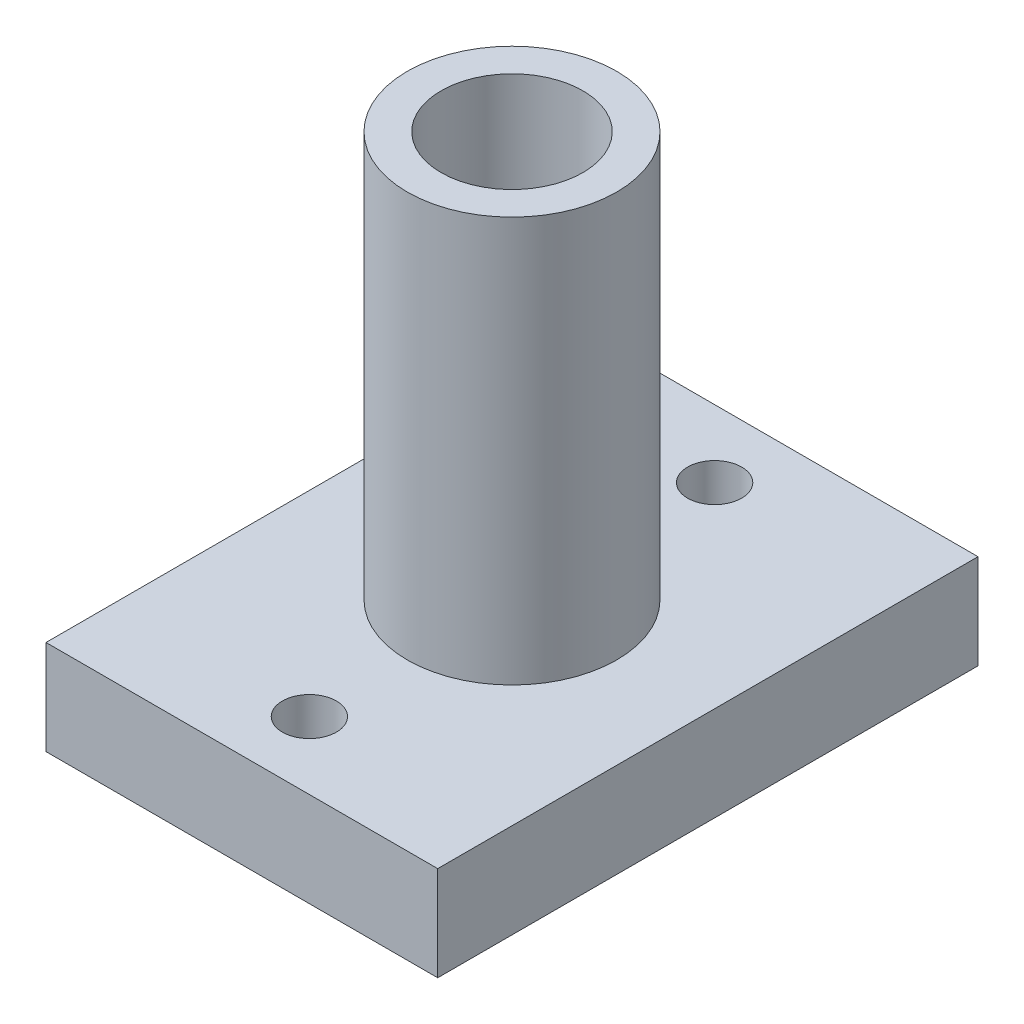
ISO-10303-21;
HEADER;
FILE_DESCRIPTION(('STEP AP214'),'2;1');
FILE_NAME('part.step','',(''),(''),'','','');
FILE_SCHEMA(('AUTOMOTIVE_DESIGN { 1 0 10303 214 1 1 1 1 }'));
ENDSEC;
DATA;
#1=APPLICATION_CONTEXT('core data for automotive mechanical design processes');
#2=APPLICATION_PROTOCOL_DEFINITION('international standard','automotive_design',2000,#1);
#3=PRODUCT_CONTEXT('',#1,'mechanical');
#4=PRODUCT('Part','Part','',(#3));
#5=PRODUCT_RELATED_PRODUCT_CATEGORY('part','',(#4));
#6=PRODUCT_DEFINITION_FORMATION('','',#4);
#7=PRODUCT_DEFINITION_CONTEXT('part definition',#1,'design');
#8=PRODUCT_DEFINITION('design','',#6,#7);
#9=PRODUCT_DEFINITION_SHAPE('','',#8);
#10=(LENGTH_UNIT() NAMED_UNIT(*) SI_UNIT(.MILLI.,.METRE.));
#11=(NAMED_UNIT(*) PLANE_ANGLE_UNIT() SI_UNIT($,.RADIAN.));
#12=(NAMED_UNIT(*) SI_UNIT($,.STERADIAN.) SOLID_ANGLE_UNIT());
#13=UNCERTAINTY_MEASURE_WITH_UNIT(LENGTH_MEASURE(1.E-05),#10,'distance_accuracy_value','');
#14=(GEOMETRIC_REPRESENTATION_CONTEXT(3) GLOBAL_UNCERTAINTY_ASSIGNED_CONTEXT((#13)) GLOBAL_UNIT_ASSIGNED_CONTEXT((#10,
#11,#12)) REPRESENTATION_CONTEXT('',''));
#15=CARTESIAN_POINT('',(0.,0.,0.));
#16=DIRECTION('',(0.,0.,1.));
#17=DIRECTION('',(1.,0.,0.));
#18=AXIS2_PLACEMENT_3D('',#15,#16,#17);
#19=CARTESIAN_POINT('',(14.5,3.5,20.));
#20=DIRECTION('',(-1.,0.,0.));
#21=DIRECTION('',(0.,0.,1.));
#22=AXIS2_PLACEMENT_3D('',#19,#20,#21);
#23=PLANE('',#22);
#24=DIRECTION('',(0.,1.,0.));
#25=VECTOR('',#24,1.);
#26=CARTESIAN_POINT('',(14.5,3.5,-20.));
#27=LINE('',#26,#25);
#28=CARTESIAN_POINT('',(14.5,-3.5,-20.));
#29=VERTEX_POINT('',#28);
#30=CARTESIAN_POINT('',(14.5,3.5,-20.));
#31=VERTEX_POINT('',#30);
#32=EDGE_CURVE('E107',#29,#31,#27,.T.);
#33=ORIENTED_EDGE('',*,*,#32,.T.);
#34=DIRECTION('',(0.,0.,-1.));
#35=VECTOR('',#34,1.);
#36=CARTESIAN_POINT('',(14.5,3.5,20.));
#37=LINE('',#36,#35);
#38=CARTESIAN_POINT('',(14.5,3.5,20.));
#39=VERTEX_POINT('',#38);
#40=EDGE_CURVE('E49',#39,#31,#37,.T.);
#41=ORIENTED_EDGE('',*,*,#40,.F.);
#42=DIRECTION('',(0.,1.,0.));
#43=VECTOR('',#42,1.);
#44=CARTESIAN_POINT('',(14.5,3.5,20.));
#45=LINE('',#44,#43);
#46=CARTESIAN_POINT('',(14.5,-3.5,20.));
#47=VERTEX_POINT('',#46);
#48=EDGE_CURVE('E93',#47,#39,#45,.T.);
#49=ORIENTED_EDGE('',*,*,#48,.F.);
#50=DIRECTION('',(0.,0.,-1.));
#51=VECTOR('',#50,1.);
#52=CARTESIAN_POINT('',(14.5,-3.5,20.));
#53=LINE('',#52,#51);
#54=EDGE_CURVE('E103',#47,#29,#53,.T.);
#55=ORIENTED_EDGE('',*,*,#54,.T.);
#56=EDGE_LOOP('',(#33,#41,#49,#55));
#57=FACE_BOUND('',#56,.T.);
#58=ADVANCED_FACE('F41',(#57),#23,.F.);
#59=CARTESIAN_POINT('',(-14.5,3.5,20.));
#60=DIRECTION('',(0.,-1.,0.));
#61=DIRECTION('',(0.,0.,-1.));
#62=AXIS2_PLACEMENT_3D('',#59,#60,#61);
#63=PLANE('',#62);
#64=CARTESIAN_POINT('',(0.,3.5,0.));
#65=DIRECTION('',(0.,-1.,0.));
#66=DIRECTION('',(0.,0.,-1.));
#67=AXIS2_PLACEMENT_3D('',#64,#65,#66);
#68=CIRCLE('',#67,7.75);
#69=CARTESIAN_POINT('',(0.,3.5,-7.75));
#70=VERTEX_POINT('',#69);
#71=EDGE_CURVE('E12',#70,#70,#68,.F.);
#72=ORIENTED_EDGE('',*,*,#71,.F.);
#73=EDGE_LOOP('',(#72));
#74=FACE_BOUND('',#73,.T.);
#75=CARTESIAN_POINT('',(0.,3.5,-15.));
#76=DIRECTION('',(0.,1.,0.));
#77=DIRECTION('',(0.,0.,1.));
#78=AXIS2_PLACEMENT_3D('',#75,#76,#77);
#79=CIRCLE('',#78,2.);
#80=CARTESIAN_POINT('',(0.,3.5,-13.));
#81=VERTEX_POINT('',#80);
#82=EDGE_CURVE('E168',#81,#81,#79,.T.);
#83=ORIENTED_EDGE('',*,*,#82,.F.);
#84=EDGE_LOOP('',(#83));
#85=FACE_BOUND('',#84,.T.);
#86=CARTESIAN_POINT('',(0.,3.5,15.));
#87=DIRECTION('',(0.,1.,0.));
#88=DIRECTION('',(0.,0.,-1.));
#89=AXIS2_PLACEMENT_3D('',#86,#87,#88);
#90=CIRCLE('',#89,2.);
#91=CARTESIAN_POINT('',(0.,3.5,13.));
#92=VERTEX_POINT('',#91);
#93=EDGE_CURVE('E165',#92,#92,#90,.T.);
#94=ORIENTED_EDGE('',*,*,#93,.F.);
#95=EDGE_LOOP('',(#94));
#96=FACE_BOUND('',#95,.T.);
#97=DIRECTION('',(-1.,0.,0.));
#98=VECTOR('',#97,1.);
#99=CARTESIAN_POINT('',(-14.5,3.5,-20.));
#100=LINE('',#99,#98);
#101=CARTESIAN_POINT('',(-14.5,3.5,-20.));
#102=VERTEX_POINT('',#101);
#103=EDGE_CURVE('E98',#31,#102,#100,.T.);
#104=ORIENTED_EDGE('',*,*,#103,.T.);
#105=DIRECTION('',(0.,0.,-1.));
#106=VECTOR('',#105,1.);
#107=CARTESIAN_POINT('',(-14.5,3.5,20.));
#108=LINE('',#107,#106);
#109=CARTESIAN_POINT('',(-14.5,3.5,20.));
#110=VERTEX_POINT('',#109);
#111=EDGE_CURVE('E96',#110,#102,#108,.T.);
#112=ORIENTED_EDGE('',*,*,#111,.F.);
#113=DIRECTION('',(-1.,0.,0.));
#114=VECTOR('',#113,1.);
#115=CARTESIAN_POINT('',(-14.5,3.5,20.));
#116=LINE('',#115,#114);
#117=EDGE_CURVE('E88',#39,#110,#116,.T.);
#118=ORIENTED_EDGE('',*,*,#117,.F.);
#119=ORIENTED_EDGE('',*,*,#40,.T.);
#120=EDGE_LOOP('',(#104,#112,#118,#119));
#121=FACE_BOUND('',#120,.T.);
#122=ADVANCED_FACE('F97',(#74,#85,#96,#121),#63,.F.);
#123=CARTESIAN_POINT('',(-14.5,3.5,20.));
#124=DIRECTION('',(1.,0.,0.));
#125=DIRECTION('',(0.,0.,-1.));
#126=AXIS2_PLACEMENT_3D('',#123,#124,#125);
#127=PLANE('',#126);
#128=DIRECTION('',(0.,-1.,0.));
#129=VECTOR('',#128,1.);
#130=CARTESIAN_POINT('',(-14.5,3.5,-20.));
#131=LINE('',#130,#129);
#132=CARTESIAN_POINT('',(-14.5,-3.5,-20.));
#133=VERTEX_POINT('',#132);
#134=EDGE_CURVE('E74',#102,#133,#131,.T.);
#135=ORIENTED_EDGE('',*,*,#134,.T.);
#136=DIRECTION('',(0.,0.,-1.));
#137=VECTOR('',#136,1.);
#138=CARTESIAN_POINT('',(-14.5,-3.5,20.));
#139=LINE('',#138,#137);
#140=CARTESIAN_POINT('',(-14.5,-3.5,20.));
#141=VERTEX_POINT('',#140);
#142=EDGE_CURVE('E99',#141,#133,#139,.T.);
#143=ORIENTED_EDGE('',*,*,#142,.F.);
#144=DIRECTION('',(0.,-1.,0.));
#145=VECTOR('',#144,1.);
#146=CARTESIAN_POINT('',(-14.5,3.5,20.));
#147=LINE('',#146,#145);
#148=EDGE_CURVE('E91',#110,#141,#147,.T.);
#149=ORIENTED_EDGE('',*,*,#148,.F.);
#150=ORIENTED_EDGE('',*,*,#111,.T.);
#151=EDGE_LOOP('',(#135,#143,#149,#150));
#152=FACE_BOUND('',#151,.T.);
#153=ADVANCED_FACE('F101',(#152),#127,.F.);
#154=CARTESIAN_POINT('',(-14.5,-3.5,20.));
#155=DIRECTION('',(0.,1.,0.));
#156=DIRECTION('',(0.,0.,1.));
#157=AXIS2_PLACEMENT_3D('',#154,#155,#156);
#158=PLANE('',#157);
#159=CARTESIAN_POINT('',(0.,-3.5,-15.));
#160=DIRECTION('',(0.,1.,0.));
#161=DIRECTION('',(0.,0.,1.));
#162=AXIS2_PLACEMENT_3D('',#159,#160,#161);
#163=CIRCLE('',#162,2.);
#164=CARTESIAN_POINT('',(0.,-3.5,-13.));
#165=VERTEX_POINT('',#164);
#166=EDGE_CURVE('E110',#165,#165,#163,.T.);
#167=ORIENTED_EDGE('',*,*,#166,.T.);
#168=EDGE_LOOP('',(#167));
#169=FACE_BOUND('',#168,.T.);
#170=CARTESIAN_POINT('',(0.,-3.5,15.));
#171=DIRECTION('',(0.,1.,0.));
#172=DIRECTION('',(0.,0.,-1.));
#173=AXIS2_PLACEMENT_3D('',#170,#171,#172);
#174=CIRCLE('',#173,2.);
#175=CARTESIAN_POINT('',(0.,-3.5,13.));
#176=VERTEX_POINT('',#175);
#177=EDGE_CURVE('E171',#176,#176,#174,.T.);
#178=ORIENTED_EDGE('',*,*,#177,.T.);
#179=EDGE_LOOP('',(#178));
#180=FACE_BOUND('',#179,.T.);
#181=DIRECTION('',(1.,0.,0.));
#182=VECTOR('',#181,1.);
#183=CARTESIAN_POINT('',(-14.5,-3.5,-20.));
#184=LINE('',#183,#182);
#185=EDGE_CURVE('E80',#133,#29,#184,.T.);
#186=ORIENTED_EDGE('',*,*,#185,.T.);
#187=ORIENTED_EDGE('',*,*,#54,.F.);
#188=DIRECTION('',(1.,0.,0.));
#189=VECTOR('',#188,1.);
#190=CARTESIAN_POINT('',(-14.5,-3.5,20.));
#191=LINE('',#190,#189);
#192=EDGE_CURVE('E57',#141,#47,#191,.T.);
#193=ORIENTED_EDGE('',*,*,#192,.F.);
#194=ORIENTED_EDGE('',*,*,#142,.T.);
#195=EDGE_LOOP('',(#186,#187,#193,#194));
#196=FACE_BOUND('',#195,.T.);
#197=ADVANCED_FACE('F129',(#169,#180,#196),#158,.F.);
#198=CARTESIAN_POINT('',(0.,0.,20.));
#199=DIRECTION('',(0.,0.,1.));
#200=DIRECTION('',(1.,0.,0.));
#201=AXIS2_PLACEMENT_3D('',#198,#199,#200);
#202=PLANE('',#201);
#203=ORIENTED_EDGE('',*,*,#48,.T.);
#204=ORIENTED_EDGE('',*,*,#117,.T.);
#205=ORIENTED_EDGE('',*,*,#148,.T.);
#206=ORIENTED_EDGE('',*,*,#192,.T.);
#207=EDGE_LOOP('',(#203,#204,#205,#206));
#208=FACE_BOUND('',#207,.T.);
#209=ADVANCED_FACE('F89',(#208),#202,.T.);
#210=CARTESIAN_POINT('',(0.,0.,-20.));
#211=DIRECTION('',(0.,0.,1.));
#212=DIRECTION('',(1.,0.,0.));
#213=AXIS2_PLACEMENT_3D('',#210,#211,#212);
#214=PLANE('',#213);
#215=ORIENTED_EDGE('',*,*,#32,.F.);
#216=ORIENTED_EDGE('',*,*,#185,.F.);
#217=ORIENTED_EDGE('',*,*,#134,.F.);
#218=ORIENTED_EDGE('',*,*,#103,.F.);
#219=EDGE_LOOP('',(#215,#216,#217,#218));
#220=FACE_BOUND('',#219,.T.);
#221=ADVANCED_FACE('F118',(#220),#214,.F.);
#222=CARTESIAN_POINT('',(0.,-3.5,15.));
#223=DIRECTION('',(0.,1.,0.));
#224=DIRECTION('',(0.,0.,1.));
#225=AXIS2_PLACEMENT_3D('',#222,#223,#224);
#226=CYLINDRICAL_SURFACE('',#225,2.);
#227=ORIENTED_EDGE('',*,*,#177,.F.);
#228=EDGE_LOOP('',(#227));
#229=FACE_BOUND('',#228,.T.);
#230=ORIENTED_EDGE('',*,*,#93,.T.);
#231=EDGE_LOOP('',(#230));
#232=FACE_BOUND('',#231,.T.);
#233=ADVANCED_FACE('F120',(#229,#232),#226,.F.);
#234=CARTESIAN_POINT('',(0.,-3.5,-15.));
#235=DIRECTION('',(0.,1.,0.));
#236=DIRECTION('',(0.,0.,1.));
#237=AXIS2_PLACEMENT_3D('',#234,#235,#236);
#238=CYLINDRICAL_SURFACE('',#237,2.);
#239=ORIENTED_EDGE('',*,*,#166,.F.);
#240=EDGE_LOOP('',(#239));
#241=FACE_BOUND('',#240,.T.);
#242=ORIENTED_EDGE('',*,*,#82,.T.);
#243=EDGE_LOOP('',(#242));
#244=FACE_BOUND('',#243,.T.);
#245=ADVANCED_FACE('F126',(#241,#244),#238,.F.);
#246=CARTESIAN_POINT('',(0.,33.5,0.));
#247=DIRECTION('',(0.,1.,0.));
#248=DIRECTION('',(0.,0.,1.));
#249=AXIS2_PLACEMENT_3D('',#246,#247,#248);
#250=PLANE('',#249);
#251=CARTESIAN_POINT('',(0.,33.5,0.));
#252=DIRECTION('',(0.,1.,0.));
#253=DIRECTION('',(1.,0.,0.));
#254=AXIS2_PLACEMENT_3D('',#251,#252,#253);
#255=CIRCLE('',#254,7.75);
#256=CARTESIAN_POINT('',(7.75,33.5,0.));
#257=VERTEX_POINT('',#256);
#258=EDGE_CURVE('E160',#257,#257,#255,.T.);
#259=ORIENTED_EDGE('',*,*,#258,.T.);
#260=EDGE_LOOP('',(#259));
#261=FACE_BOUND('',#260,.T.);
#262=CARTESIAN_POINT('',(0.,33.5,0.));
#263=DIRECTION('',(0.,1.,0.));
#264=DIRECTION('',(0.,0.,1.));
#265=AXIS2_PLACEMENT_3D('',#262,#263,#264);
#266=CIRCLE('',#265,5.25);
#267=CARTESIAN_POINT('',(0.,33.5,5.25));
#268=VERTEX_POINT('',#267);
#269=EDGE_CURVE('E157',#268,#268,#266,.T.);
#270=ORIENTED_EDGE('',*,*,#269,.F.);
#271=EDGE_LOOP('',(#270));
#272=FACE_BOUND('',#271,.T.);
#273=ADVANCED_FACE('F188',(#261,#272),#250,.T.);
#274=CARTESIAN_POINT('',(0.,33.5,0.));
#275=DIRECTION('',(0.,-1.,0.));
#276=DIRECTION('',(0.,0.,-1.));
#277=AXIS2_PLACEMENT_3D('',#274,#275,#276);
#278=CYLINDRICAL_SURFACE('',#277,7.75);
#279=ORIENTED_EDGE('',*,*,#258,.F.);
#280=EDGE_LOOP('',(#279));
#281=FACE_BOUND('',#280,.T.);
#282=ORIENTED_EDGE('',*,*,#71,.T.);
#283=EDGE_LOOP('',(#282));
#284=FACE_BOUND('',#283,.T.);
#285=ADVANCED_FACE('F150',(#281,#284),#278,.T.);
#286=CARTESIAN_POINT('',(0.,33.5,0.));
#287=DIRECTION('',(0.,-1.,0.));
#288=DIRECTION('',(0.,0.,-1.));
#289=AXIS2_PLACEMENT_3D('',#286,#287,#288);
#290=CYLINDRICAL_SURFACE('',#289,5.25);
#291=ORIENTED_EDGE('',*,*,#269,.T.);
#292=EDGE_LOOP('',(#291));
#293=FACE_BOUND('',#292,.T.);
#294=CARTESIAN_POINT('',(0.,3.5,0.));
#295=DIRECTION('',(0.,1.,0.));
#296=DIRECTION('',(0.,0.,1.));
#297=AXIS2_PLACEMENT_3D('',#294,#295,#296);
#298=CIRCLE('',#297,5.25);
#299=CARTESIAN_POINT('',(0.,3.5,5.25));
#300=VERTEX_POINT('',#299);
#301=EDGE_CURVE('E155',#300,#300,#298,.T.);
#302=ORIENTED_EDGE('',*,*,#301,.F.);
#303=EDGE_LOOP('',(#302));
#304=FACE_BOUND('',#303,.T.);
#305=ADVANCED_FACE('F145',(#293,#304),#290,.F.);
#306=ORIENTED_EDGE('',*,*,#301,.T.);
#307=EDGE_LOOP('',(#306));
#308=FACE_BOUND('',#307,.T.);
#309=ADVANCED_FACE('F137',(#308),#63,.F.);
#310=CLOSED_SHELL('',(#58,#122,#153,#197,#209,#221,#233,#245,#273,#285,#305,#309));
#311=MANIFOLD_SOLID_BREP('B2',#310);
#312=ADVANCED_BREP_SHAPE_REPRESENTATION('',(#18,#311),#14);
#313=SHAPE_DEFINITION_REPRESENTATION(#9,#312);
ENDSEC;
END-ISO-10303-21;
